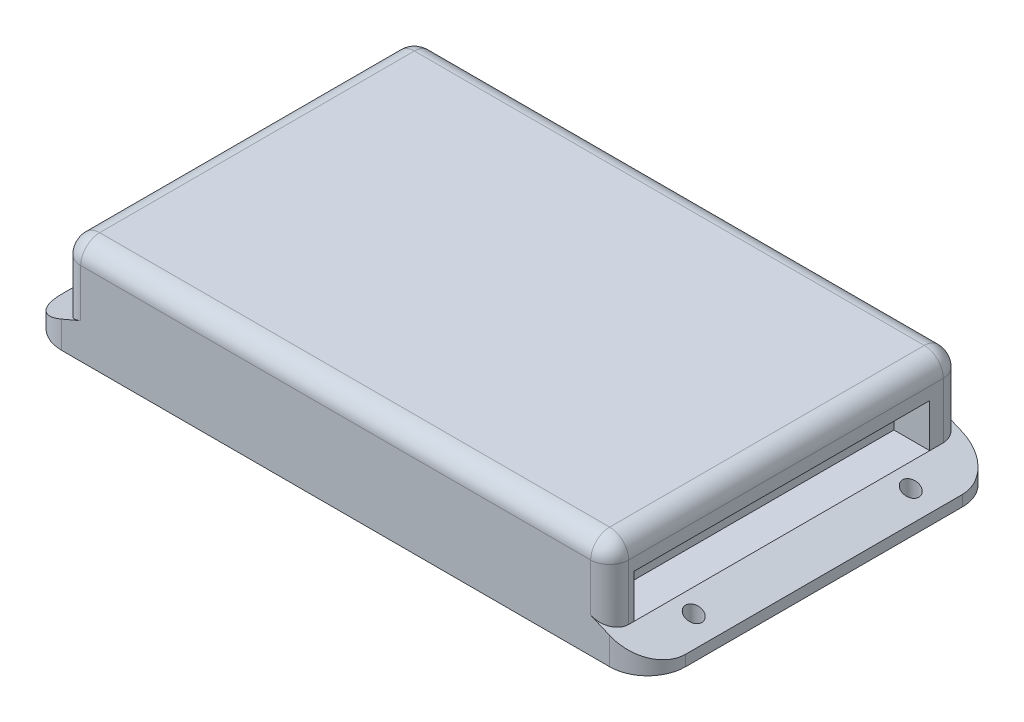
ISO-10303-21;
HEADER;
FILE_DESCRIPTION(('STEP AP214'),'2;1');
FILE_NAME('part.step','',(''),(''),'','','');
FILE_SCHEMA(('AUTOMOTIVE_DESIGN { 1 0 10303 214 1 1 1 1 }'));
ENDSEC;
DATA;
#1=APPLICATION_CONTEXT('core data for automotive mechanical design processes');
#2=APPLICATION_PROTOCOL_DEFINITION('international standard','automotive_design',2000,#1);
#3=PRODUCT_CONTEXT('',#1,'mechanical');
#4=PRODUCT('Part','Part','',(#3));
#5=PRODUCT_RELATED_PRODUCT_CATEGORY('part','',(#4));
#6=PRODUCT_DEFINITION_FORMATION('','',#4);
#7=PRODUCT_DEFINITION_CONTEXT('part definition',#1,'design');
#8=PRODUCT_DEFINITION('design','',#6,#7);
#9=PRODUCT_DEFINITION_SHAPE('','',#8);
#10=(LENGTH_UNIT() NAMED_UNIT(*) SI_UNIT(.MILLI.,.METRE.));
#11=(NAMED_UNIT(*) PLANE_ANGLE_UNIT() SI_UNIT($,.RADIAN.));
#12=(NAMED_UNIT(*) SI_UNIT($,.STERADIAN.) SOLID_ANGLE_UNIT());
#13=UNCERTAINTY_MEASURE_WITH_UNIT(LENGTH_MEASURE(1.E-05),#10,'distance_accuracy_value','');
#14=(GEOMETRIC_REPRESENTATION_CONTEXT(3) GLOBAL_UNCERTAINTY_ASSIGNED_CONTEXT((#13)) GLOBAL_UNIT_ASSIGNED_CONTEXT((#10,
#11,#12)) REPRESENTATION_CONTEXT('',''));
#15=CARTESIAN_POINT('',(0.,0.,0.));
#16=DIRECTION('',(0.,0.,1.));
#17=DIRECTION('',(1.,0.,0.));
#18=AXIS2_PLACEMENT_3D('',#15,#16,#17);
#19=CARTESIAN_POINT('',(57.5,5.,32.5));
#20=DIRECTION('',(-1.,0.,0.));
#21=DIRECTION('',(0.,0.,1.));
#22=AXIS2_PLACEMENT_3D('',#19,#20,#21);
#23=PLANE('',#22);
#24=DIRECTION('',(0.,0.,-1.));
#25=VECTOR('',#24,1.);
#26=CARTESIAN_POINT('',(57.5,0.,32.5));
#27=LINE('',#26,#25);
#28=CARTESIAN_POINT('',(57.5,0.,25.5));
#29=VERTEX_POINT('',#28);
#30=CARTESIAN_POINT('',(57.5,0.,-25.5));
#31=VERTEX_POINT('',#30);
#32=EDGE_CURVE('E296',#29,#31,#27,.T.);
#33=ORIENTED_EDGE('',*,*,#32,.T.);
#34=DIRECTION('',(0.,-1.,0.));
#35=VECTOR('',#34,1.);
#36=CARTESIAN_POINT('',(57.5,5.,-25.5));
#37=LINE('',#36,#35);
#38=CARTESIAN_POINT('',(57.5,2.,-25.5));
#39=VERTEX_POINT('',#38);
#40=EDGE_CURVE('E367',#31,#39,#37,.F.);
#41=ORIENTED_EDGE('',*,*,#40,.T.);
#42=DIRECTION('',(0.,0.,1.));
#43=VECTOR('',#42,1.);
#44=CARTESIAN_POINT('',(57.5,2.,32.5));
#45=LINE('',#44,#43);
#46=CARTESIAN_POINT('',(57.5,2.,25.5));
#47=VERTEX_POINT('',#46);
#48=EDGE_CURVE('E323',#39,#47,#45,.T.);
#49=ORIENTED_EDGE('',*,*,#48,.T.);
#50=DIRECTION('',(0.,-1.,0.));
#51=VECTOR('',#50,1.);
#52=CARTESIAN_POINT('',(57.5,5.,25.5));
#53=LINE('',#52,#51);
#54=EDGE_CURVE('E364',#47,#29,#53,.T.);
#55=ORIENTED_EDGE('',*,*,#54,.T.);
#56=EDGE_LOOP('',(#33,#41,#49,#55));
#57=FACE_BOUND('',#56,.T.);
#58=ADVANCED_FACE('F41',(#57),#23,.F.);
#59=CARTESIAN_POINT('',(-57.5,5.,-32.5));
#60=DIRECTION('',(0.,0.,1.));
#61=DIRECTION('',(1.,0.,0.));
#62=AXIS2_PLACEMENT_3D('',#59,#60,#61);
#63=PLANE('',#62);
#64=DIRECTION('',(0.,-1.,0.));
#65=VECTOR('',#64,1.);
#66=CARTESIAN_POINT('',(46.9999999999999,5.,-32.5));
#67=LINE('',#66,#65);
#68=CARTESIAN_POINT('',(46.9999999999999,15.3,-32.5));
#69=VERTEX_POINT('',#68);
#70=CARTESIAN_POINT('',(46.9999999999999,6.49999999999999,-32.5));
#71=VERTEX_POINT('',#70);
#72=EDGE_CURVE('E415',#69,#71,#67,.T.);
#73=ORIENTED_EDGE('',*,*,#72,.T.);
#74=DIRECTION('',(-0.919145030018059,0.393919298579166,0.));
#75=VECTOR('',#74,1.);
#76=CARTESIAN_POINT('',(50.5,5.,-32.5));
#77=LINE('',#76,#75);
#78=CARTESIAN_POINT('',(50.5,5.,-32.5));
#79=VERTEX_POINT('',#78);
#80=EDGE_CURVE('E418',#71,#79,#77,.F.);
#81=ORIENTED_EDGE('',*,*,#80,.T.);
#82=DIRECTION('',(0.,-1.,0.));
#83=VECTOR('',#82,1.);
#84=CARTESIAN_POINT('',(50.5,5.,-32.5));
#85=LINE('',#84,#83);
#86=CARTESIAN_POINT('',(50.5,0.,-32.5));
#87=VERTEX_POINT('',#86);
#88=EDGE_CURVE('E347',#79,#87,#85,.T.);
#89=ORIENTED_EDGE('',*,*,#88,.T.);
#90=DIRECTION('',(-1.,0.,0.));
#91=VECTOR('',#90,1.);
#92=CARTESIAN_POINT('',(-57.5,0.,-32.5));
#93=LINE('',#92,#91);
#94=CARTESIAN_POINT('',(-50.5,0.,-32.5));
#95=VERTEX_POINT('',#94);
#96=EDGE_CURVE('E303',#87,#95,#93,.T.);
#97=ORIENTED_EDGE('',*,*,#96,.T.);
#98=DIRECTION('',(0.,-1.,0.));
#99=VECTOR('',#98,1.);
#100=CARTESIAN_POINT('',(-50.5,5.,-32.5));
#101=LINE('',#100,#99);
#102=CARTESIAN_POINT('',(-50.5,5.,-32.5));
#103=VERTEX_POINT('',#102);
#104=EDGE_CURVE('E350',#95,#103,#101,.F.);
#105=ORIENTED_EDGE('',*,*,#104,.T.);
#106=DIRECTION('',(-0.919145030018059,-0.393919298579166,0.));
#107=VECTOR('',#106,1.);
#108=CARTESIAN_POINT('',(-50.5,5.,-32.5));
#109=LINE('',#108,#107);
#110=CARTESIAN_POINT('',(-46.9999999999999,6.5,-32.5));
#111=VERTEX_POINT('',#110);
#112=EDGE_CURVE('E410',#103,#111,#109,.F.);
#113=ORIENTED_EDGE('',*,*,#112,.T.);
#114=DIRECTION('',(0.,-1.,0.));
#115=VECTOR('',#114,1.);
#116=CARTESIAN_POINT('',(-46.9999999999999,5.,-32.5));
#117=LINE('',#116,#115);
#118=CARTESIAN_POINT('',(-46.9999999999999,15.3,-32.5));
#119=VERTEX_POINT('',#118);
#120=EDGE_CURVE('E408',#111,#119,#117,.F.);
#121=ORIENTED_EDGE('',*,*,#120,.T.);
#122=DIRECTION('',(1.,0.,0.));
#123=VECTOR('',#122,1.);
#124=CARTESIAN_POINT('',(-57.5,15.3,-32.5));
#125=LINE('',#124,#123);
#126=EDGE_CURVE('E413',#119,#69,#125,.T.);
#127=ORIENTED_EDGE('',*,*,#126,.T.);
#128=EDGE_LOOP('',(#73,#81,#89,#97,#105,#113,#121,#127));
#129=FACE_BOUND('',#128,.T.);
#130=ADVANCED_FACE('F471',(#129),#63,.F.);
#131=CARTESIAN_POINT('',(-57.5,5.,32.5));
#132=DIRECTION('',(1.,0.,0.));
#133=DIRECTION('',(0.,0.,-1.));
#134=AXIS2_PLACEMENT_3D('',#131,#132,#133);
#135=PLANE('',#134);
#136=DIRECTION('',(0.,0.,-1.));
#137=VECTOR('',#136,1.);
#138=CARTESIAN_POINT('',(-57.5,2.,32.5));
#139=LINE('',#138,#137);
#140=CARTESIAN_POINT('',(-57.5,2.,25.5));
#141=VERTEX_POINT('',#140);
#142=CARTESIAN_POINT('',(-57.5,2.,-25.5));
#143=VERTEX_POINT('',#142);
#144=EDGE_CURVE('E320',#141,#143,#139,.T.);
#145=ORIENTED_EDGE('',*,*,#144,.T.);
#146=DIRECTION('',(0.,-1.,0.));
#147=VECTOR('',#146,1.);
#148=CARTESIAN_POINT('',(-57.5,5.,-25.5));
#149=LINE('',#148,#147);
#150=CARTESIAN_POINT('',(-57.5,0.,-25.5));
#151=VERTEX_POINT('',#150);
#152=EDGE_CURVE('E336',#143,#151,#149,.T.);
#153=ORIENTED_EDGE('',*,*,#152,.T.);
#154=DIRECTION('',(0.,0.,1.));
#155=VECTOR('',#154,1.);
#156=CARTESIAN_POINT('',(-57.5,0.,32.5));
#157=LINE('',#156,#155);
#158=CARTESIAN_POINT('',(-57.5,0.,25.5));
#159=VERTEX_POINT('',#158);
#160=EDGE_CURVE('E306',#151,#159,#157,.T.);
#161=ORIENTED_EDGE('',*,*,#160,.T.);
#162=DIRECTION('',(0.,-1.,0.));
#163=VECTOR('',#162,1.);
#164=CARTESIAN_POINT('',(-57.5,5.,25.5));
#165=LINE('',#164,#163);
#166=EDGE_CURVE('E326',#159,#141,#165,.F.);
#167=ORIENTED_EDGE('',*,*,#166,.T.);
#168=EDGE_LOOP('',(#145,#153,#161,#167));
#169=FACE_BOUND('',#168,.T.);
#170=ADVANCED_FACE('F510',(#169),#135,.F.);
#171=CARTESIAN_POINT('',(-57.5,5.,32.5));
#172=DIRECTION('',(0.,0.,-1.));
#173=DIRECTION('',(-1.,0.,0.));
#174=AXIS2_PLACEMENT_3D('',#171,#172,#173);
#175=PLANE('',#174);
#176=DIRECTION('',(0.,-1.,0.));
#177=VECTOR('',#176,1.);
#178=CARTESIAN_POINT('',(-46.9999999999999,5.,32.5));
#179=LINE('',#178,#177);
#180=CARTESIAN_POINT('',(-46.9999999999999,15.3,32.5));
#181=VERTEX_POINT('',#180);
#182=CARTESIAN_POINT('',(-46.9999999999999,6.5,32.5));
#183=VERTEX_POINT('',#182);
#184=EDGE_CURVE('E397',#181,#183,#179,.T.);
#185=ORIENTED_EDGE('',*,*,#184,.T.);
#186=DIRECTION('',(0.919145030018059,0.393919298579166,0.));
#187=VECTOR('',#186,1.);
#188=CARTESIAN_POINT('',(-50.5,5.,32.5));
#189=LINE('',#188,#187);
#190=CARTESIAN_POINT('',(-50.5,5.,32.5));
#191=VERTEX_POINT('',#190);
#192=EDGE_CURVE('E400',#183,#191,#189,.F.);
#193=ORIENTED_EDGE('',*,*,#192,.T.);
#194=DIRECTION('',(0.,-1.,0.));
#195=VECTOR('',#194,1.);
#196=CARTESIAN_POINT('',(-50.5,5.,32.5));
#197=LINE('',#196,#195);
#198=CARTESIAN_POINT('',(-50.5,0.,32.5));
#199=VERTEX_POINT('',#198);
#200=EDGE_CURVE('E361',#191,#199,#197,.T.);
#201=ORIENTED_EDGE('',*,*,#200,.T.);
#202=DIRECTION('',(1.,0.,0.));
#203=VECTOR('',#202,1.);
#204=CARTESIAN_POINT('',(-57.5,0.,32.5));
#205=LINE('',#204,#203);
#206=CARTESIAN_POINT('',(50.5,0.,32.5));
#207=VERTEX_POINT('',#206);
#208=EDGE_CURVE('E309',#199,#207,#205,.T.);
#209=ORIENTED_EDGE('',*,*,#208,.T.);
#210=DIRECTION('',(0.,-1.,0.));
#211=VECTOR('',#210,1.);
#212=CARTESIAN_POINT('',(50.5,5.,32.5));
#213=LINE('',#212,#211);
#214=CARTESIAN_POINT('',(50.5,5.,32.5));
#215=VERTEX_POINT('',#214);
#216=EDGE_CURVE('E358',#207,#215,#213,.F.);
#217=ORIENTED_EDGE('',*,*,#216,.T.);
#218=DIRECTION('',(0.919145030018059,-0.393919298579166,0.));
#219=VECTOR('',#218,1.);
#220=CARTESIAN_POINT('',(50.5,5.,32.5));
#221=LINE('',#220,#219);
#222=CARTESIAN_POINT('',(46.9999999999999,6.49999999999999,32.5));
#223=VERTEX_POINT('',#222);
#224=EDGE_CURVE('E392',#215,#223,#221,.F.);
#225=ORIENTED_EDGE('',*,*,#224,.T.);
#226=DIRECTION('',(0.,-1.,0.));
#227=VECTOR('',#226,1.);
#228=CARTESIAN_POINT('',(46.9999999999999,5.,32.5));
#229=LINE('',#228,#227);
#230=CARTESIAN_POINT('',(46.9999999999999,15.3,32.5));
#231=VERTEX_POINT('',#230);
#232=EDGE_CURVE('E390',#223,#231,#229,.F.);
#233=ORIENTED_EDGE('',*,*,#232,.T.);
#234=DIRECTION('',(-1.,0.,0.));
#235=VECTOR('',#234,1.);
#236=CARTESIAN_POINT('',(-57.5,15.3,32.5));
#237=LINE('',#236,#235);
#238=EDGE_CURVE('E395',#231,#181,#237,.T.);
#239=ORIENTED_EDGE('',*,*,#238,.T.);
#240=EDGE_LOOP('',(#185,#193,#201,#209,#217,#225,#233,#239));
#241=FACE_BOUND('',#240,.T.);
#242=ADVANCED_FACE('F503',(#241),#175,.F.);
#243=CARTESIAN_POINT('',(0.,0.,0.));
#244=DIRECTION('',(0.,-1.,0.));
#245=DIRECTION('',(0.,0.,-1.));
#246=AXIS2_PLACEMENT_3D('',#243,#244,#245);
#247=PLANE('',#246);
#248=CARTESIAN_POINT('',(-53.5,0.,-20.));
#249=DIRECTION('',(0.,-1.,0.));
#250=DIRECTION('',(0.,0.,1.));
#251=AXIS2_PLACEMENT_3D('',#248,#249,#250);
#252=CIRCLE('',#251,1.5);
#253=CARTESIAN_POINT('',(-53.5,0.,-18.5));
#254=VERTEX_POINT('',#253);
#255=EDGE_CURVE('E284',#254,#254,#252,.T.);
#256=ORIENTED_EDGE('',*,*,#255,.F.);
#257=EDGE_LOOP('',(#256));
#258=FACE_BOUND('',#257,.T.);
#259=CARTESIAN_POINT('',(-53.5,0.,20.));
#260=DIRECTION('',(0.,-1.,0.));
#261=DIRECTION('',(0.,0.,1.));
#262=AXIS2_PLACEMENT_3D('',#259,#260,#261);
#263=CIRCLE('',#262,1.5);
#264=CARTESIAN_POINT('',(-53.5,0.,21.5));
#265=VERTEX_POINT('',#264);
#266=EDGE_CURVE('E289',#265,#265,#263,.T.);
#267=ORIENTED_EDGE('',*,*,#266,.F.);
#268=EDGE_LOOP('',(#267));
#269=FACE_BOUND('',#268,.T.);
#270=CARTESIAN_POINT('',(53.5,0.,-20.));
#271=DIRECTION('',(0.,1.,0.));
#272=DIRECTION('',(0.,0.,1.));
#273=AXIS2_PLACEMENT_3D('',#270,#271,#272);
#274=CIRCLE('',#273,1.5);
#275=CARTESIAN_POINT('',(53.5,0.,-18.5));
#276=VERTEX_POINT('',#275);
#277=EDGE_CURVE('E293',#276,#276,#274,.T.);
#278=ORIENTED_EDGE('',*,*,#277,.T.);
#279=EDGE_LOOP('',(#278));
#280=FACE_BOUND('',#279,.T.);
#281=CARTESIAN_POINT('',(53.5,0.,20.));
#282=DIRECTION('',(0.,1.,0.));
#283=DIRECTION('',(0.,0.,1.));
#284=AXIS2_PLACEMENT_3D('',#281,#282,#283);
#285=CIRCLE('',#284,1.5);
#286=CARTESIAN_POINT('',(53.5,0.,21.5));
#287=VERTEX_POINT('',#286);
#288=EDGE_CURVE('E287',#287,#287,#285,.T.);
#289=ORIENTED_EDGE('',*,*,#288,.T.);
#290=EDGE_LOOP('',(#289));
#291=FACE_BOUND('',#290,.T.);
#292=ORIENTED_EDGE('',*,*,#160,.F.);
#293=CARTESIAN_POINT('',(-50.5,0.,-25.5));
#294=DIRECTION('',(0.,-1.,0.));
#295=DIRECTION('',(0.,0.,-1.));
#296=AXIS2_PLACEMENT_3D('',#293,#294,#295);
#297=CIRCLE('',#296,7.);
#298=EDGE_CURVE('E345',#151,#95,#297,.T.);
#299=ORIENTED_EDGE('',*,*,#298,.T.);
#300=ORIENTED_EDGE('',*,*,#96,.F.);
#301=CARTESIAN_POINT('',(50.5,0.,-25.5));
#302=DIRECTION('',(0.,-1.,0.));
#303=DIRECTION('',(0.,0.,-1.));
#304=AXIS2_PLACEMENT_3D('',#301,#302,#303);
#305=CIRCLE('',#304,7.);
#306=EDGE_CURVE('E341',#87,#31,#305,.T.);
#307=ORIENTED_EDGE('',*,*,#306,.T.);
#308=ORIENTED_EDGE('',*,*,#32,.F.);
#309=CARTESIAN_POINT('',(50.5,0.,25.5));
#310=DIRECTION('',(0.,-1.,0.));
#311=DIRECTION('',(0.,0.,-1.));
#312=AXIS2_PLACEMENT_3D('',#309,#310,#311);
#313=CIRCLE('',#312,7.);
#314=EDGE_CURVE('E339',#29,#207,#313,.T.);
#315=ORIENTED_EDGE('',*,*,#314,.T.);
#316=ORIENTED_EDGE('',*,*,#208,.F.);
#317=CARTESIAN_POINT('',(-50.5,0.,25.5));
#318=DIRECTION('',(0.,-1.,0.));
#319=DIRECTION('',(0.,0.,-1.));
#320=AXIS2_PLACEMENT_3D('',#317,#318,#319);
#321=CIRCLE('',#320,7.);
#322=EDGE_CURVE('E343',#199,#159,#321,.T.);
#323=ORIENTED_EDGE('',*,*,#322,.T.);
#324=EDGE_LOOP('',(#292,#299,#300,#307,#308,#315,#316,#323));
#325=FACE_BOUND('',#324,.T.);
#326=ADVANCED_FACE('F494',(#258,#269,#280,#291,#325),#247,.T.);
#327=CARTESIAN_POINT('',(53.5,0.,20.));
#328=DIRECTION('',(0.,1.,0.));
#329=DIRECTION('',(0.,0.,1.));
#330=AXIS2_PLACEMENT_3D('',#327,#328,#329);
#331=CYLINDRICAL_SURFACE('',#330,1.5);
#332=ORIENTED_EDGE('',*,*,#288,.F.);
#333=EDGE_LOOP('',(#332));
#334=FACE_BOUND('',#333,.T.);
#335=CARTESIAN_POINT('',(53.5,3.7142857142857,20.));
#336=DIRECTION('',(-0.393919298579166,-0.919145030018059,0.));
#337=DIRECTION('',(-0.919145030018059,0.393919298579166,0.));
#338=AXIS2_PLACEMENT_3D('',#335,#336,#337);
#339=ELLIPSE('',#338,1.63195137982798,1.5);
#340=CARTESIAN_POINT('',(52.,4.35714285714284,20.));
#341=VERTEX_POINT('',#340);
#342=EDGE_CURVE('E300',#341,#341,#339,.F.);
#343=ORIENTED_EDGE('',*,*,#342,.T.);
#344=EDGE_LOOP('',(#343));
#345=FACE_BOUND('',#344,.T.);
#346=ADVANCED_FACE('F657',(#334,#345),#331,.F.);
#347=CARTESIAN_POINT('',(53.5,0.,-20.));
#348=DIRECTION('',(0.,1.,0.));
#349=DIRECTION('',(0.,0.,1.));
#350=AXIS2_PLACEMENT_3D('',#347,#348,#349);
#351=CYLINDRICAL_SURFACE('',#350,1.5);
#352=ORIENTED_EDGE('',*,*,#277,.F.);
#353=EDGE_LOOP('',(#352));
#354=FACE_BOUND('',#353,.T.);
#355=CARTESIAN_POINT('',(53.5,3.7142857142857,-20.));
#356=DIRECTION('',(-0.393919298579166,-0.919145030018059,0.));
#357=DIRECTION('',(-0.919145030018059,0.393919298579166,0.));
#358=AXIS2_PLACEMENT_3D('',#355,#356,#357);
#359=ELLIPSE('',#358,1.63195137982798,1.5);
#360=CARTESIAN_POINT('',(52.,4.35714285714284,-20.));
#361=VERTEX_POINT('',#360);
#362=EDGE_CURVE('E297',#361,#361,#359,.F.);
#363=ORIENTED_EDGE('',*,*,#362,.T.);
#364=EDGE_LOOP('',(#363));
#365=FACE_BOUND('',#364,.T.);
#366=ADVANCED_FACE('F653',(#354,#365),#351,.F.);
#367=CARTESIAN_POINT('',(-53.5,0.,20.));
#368=DIRECTION('',(0.,1.,0.));
#369=DIRECTION('',(0.,0.,1.));
#370=AXIS2_PLACEMENT_3D('',#367,#368,#369);
#371=CYLINDRICAL_SURFACE('',#370,1.5);
#372=ORIENTED_EDGE('',*,*,#266,.T.);
#373=EDGE_LOOP('',(#372));
#374=FACE_BOUND('',#373,.T.);
#375=CARTESIAN_POINT('',(-53.5,3.71428571428571,20.));
#376=DIRECTION('',(0.393919298579166,-0.919145030018059,0.));
#377=DIRECTION('',(0.919145030018059,0.393919298579166,0.));
#378=AXIS2_PLACEMENT_3D('',#375,#376,#377);
#379=ELLIPSE('',#378,1.63195137982798,1.5);
#380=CARTESIAN_POINT('',(-52.,4.35714285714285,20.));
#381=VERTEX_POINT('',#380);
#382=EDGE_CURVE('E292',#381,#381,#379,.T.);
#383=ORIENTED_EDGE('',*,*,#382,.F.);
#384=EDGE_LOOP('',(#383));
#385=FACE_BOUND('',#384,.T.);
#386=ADVANCED_FACE('F649',(#374,#385),#371,.F.);
#387=CARTESIAN_POINT('',(-53.5,0.,-20.));
#388=DIRECTION('',(0.,1.,0.));
#389=DIRECTION('',(0.,0.,1.));
#390=AXIS2_PLACEMENT_3D('',#387,#388,#389);
#391=CYLINDRICAL_SURFACE('',#390,1.5);
#392=ORIENTED_EDGE('',*,*,#255,.T.);
#393=EDGE_LOOP('',(#392));
#394=FACE_BOUND('',#393,.T.);
#395=CARTESIAN_POINT('',(-53.5,3.71428571428571,-20.));
#396=DIRECTION('',(0.393919298579166,-0.919145030018059,0.));
#397=DIRECTION('',(0.919145030018059,0.393919298579166,0.));
#398=AXIS2_PLACEMENT_3D('',#395,#396,#397);
#399=ELLIPSE('',#398,1.63195137982798,1.5);
#400=CARTESIAN_POINT('',(-52.,4.35714285714285,-20.));
#401=VERTEX_POINT('',#400);
#402=EDGE_CURVE('E288',#401,#401,#399,.T.);
#403=ORIENTED_EDGE('',*,*,#402,.F.);
#404=EDGE_LOOP('',(#403));
#405=FACE_BOUND('',#404,.T.);
#406=ADVANCED_FACE('F567',(#394,#405),#391,.F.);
#407=CARTESIAN_POINT('',(-50.5,5.,0.));
#408=DIRECTION('',(0.393919298579166,-0.919145030018059,0.));
#409=DIRECTION('',(0.,0.,1.));
#410=AXIS2_PLACEMENT_3D('',#407,#408,#409);
#411=PLANE('',#410);
#412=DIRECTION('',(0.,0.,1.));
#413=VECTOR('',#412,1.);
#414=CARTESIAN_POINT('',(-50.5,5.,0.));
#415=LINE('',#414,#413);
#416=CARTESIAN_POINT('',(-50.5,5.,-29.));
#417=VERTEX_POINT('',#416);
#418=CARTESIAN_POINT('',(-50.5,5.,-13.5));
#419=VERTEX_POINT('',#418);
#420=EDGE_CURVE('E317',#417,#419,#415,.T.);
#421=ORIENTED_EDGE('',*,*,#420,.F.);
#422=CARTESIAN_POINT('',(-46.9999999999999,6.50000000000001,-29.));
#423=DIRECTION('',(0.393919298579166,-0.919145030018059,0.));
#424=DIRECTION('',(-0.919145030018059,-0.393919298579166,0.));
#425=AXIS2_PLACEMENT_3D('',#422,#423,#424);
#426=ELLIPSE('',#425,3.80788655293195,3.5);
#427=EDGE_CURVE('E423',#417,#111,#426,.T.);
#428=ORIENTED_EDGE('',*,*,#427,.T.);
#429=ORIENTED_EDGE('',*,*,#112,.F.);
#430=CARTESIAN_POINT('',(-50.5,4.99999999999998,-25.5));
#431=DIRECTION('',(0.393919298579166,-0.919145030018059,0.));
#432=DIRECTION('',(-0.919145030018059,-0.393919298579166,0.));
#433=AXIS2_PLACEMENT_3D('',#430,#431,#432);
#434=ELLIPSE('',#433,7.6157731058639,7.);
#435=EDGE_CURVE('E356',#103,#143,#434,.F.);
#436=ORIENTED_EDGE('',*,*,#435,.T.);
#437=ORIENTED_EDGE('',*,*,#144,.F.);
#438=CARTESIAN_POINT('',(-50.5,4.99999999999998,25.5));
#439=DIRECTION('',(0.393919298579166,-0.919145030018059,0.));
#440=DIRECTION('',(-0.919145030018059,-0.393919298579166,0.));
#441=AXIS2_PLACEMENT_3D('',#438,#439,#440);
#442=ELLIPSE('',#441,7.6157731058639,7.);
#443=EDGE_CURVE('E353',#141,#191,#442,.F.);
#444=ORIENTED_EDGE('',*,*,#443,.T.);
#445=ORIENTED_EDGE('',*,*,#192,.F.);
#446=CARTESIAN_POINT('',(-46.9999999999999,6.5,29.));
#447=DIRECTION('',(0.393919298579166,-0.919145030018059,0.));
#448=DIRECTION('',(-0.919145030018059,-0.393919298579166,0.));
#449=AXIS2_PLACEMENT_3D('',#446,#447,#448);
#450=ELLIPSE('',#449,3.80788655293195,3.5);
#451=CARTESIAN_POINT('',(-50.5,5.,29.));
#452=VERTEX_POINT('',#451);
#453=EDGE_CURVE('E50',#183,#452,#450,.T.);
#454=ORIENTED_EDGE('',*,*,#453,.T.);
#455=CARTESIAN_POINT('',(-50.5,5.,12.5));
#456=VERTEX_POINT('',#455);
#457=EDGE_CURVE('E316',#456,#452,#415,.T.);
#458=ORIENTED_EDGE('',*,*,#457,.F.);
#459=DIRECTION('',(0.,0.,1.));
#460=VECTOR('',#459,1.);
#461=CARTESIAN_POINT('',(-50.5,5.,12.5));
#462=LINE('',#461,#460);
#463=EDGE_CURVE('E268',#419,#456,#462,.T.);
#464=ORIENTED_EDGE('',*,*,#463,.F.);
#465=EDGE_LOOP('',(#421,#428,#429,#436,#437,#444,#445,#454,#458,#464));
#466=FACE_BOUND('',#465,.T.);
#467=ORIENTED_EDGE('',*,*,#382,.T.);
#468=EDGE_LOOP('',(#467));
#469=FACE_BOUND('',#468,.T.);
#470=ORIENTED_EDGE('',*,*,#402,.T.);
#471=EDGE_LOOP('',(#470));
#472=FACE_BOUND('',#471,.T.);
#473=ADVANCED_FACE('F525',(#466,#469,#472),#411,.F.);
#474=CARTESIAN_POINT('',(50.5,5.,0.));
#475=DIRECTION('',(-0.393919298579166,-0.919145030018059,0.));
#476=DIRECTION('',(0.,0.,-1.));
#477=AXIS2_PLACEMENT_3D('',#474,#475,#476);
#478=PLANE('',#477);
#479=ORIENTED_EDGE('',*,*,#48,.F.);
#480=CARTESIAN_POINT('',(50.5,4.99999999999998,-25.5));
#481=DIRECTION('',(-0.393919298579166,-0.919145030018059,0.));
#482=DIRECTION('',(0.919145030018059,-0.393919298579166,0.));
#483=AXIS2_PLACEMENT_3D('',#480,#481,#482);
#484=ELLIPSE('',#483,7.6157731058639,7.);
#485=EDGE_CURVE('E371',#39,#79,#484,.F.);
#486=ORIENTED_EDGE('',*,*,#485,.T.);
#487=ORIENTED_EDGE('',*,*,#80,.F.);
#488=CARTESIAN_POINT('',(46.9999999999999,6.49999999999999,-29.));
#489=DIRECTION('',(-0.393919298579166,-0.919145030018059,0.));
#490=DIRECTION('',(0.919145030018059,-0.393919298579166,0.));
#491=AXIS2_PLACEMENT_3D('',#488,#489,#490);
#492=ELLIPSE('',#491,3.80788655293195,3.5);
#493=CARTESIAN_POINT('',(50.5,5.,-29.));
#494=VERTEX_POINT('',#493);
#495=EDGE_CURVE('E420',#71,#494,#492,.T.);
#496=ORIENTED_EDGE('',*,*,#495,.T.);
#497=DIRECTION('',(0.,0.,-1.));
#498=VECTOR('',#497,1.);
#499=CARTESIAN_POINT('',(50.5,5.,0.));
#500=LINE('',#499,#498);
#501=CARTESIAN_POINT('',(50.5,5.,-26.5));
#502=VERTEX_POINT('',#501);
#503=EDGE_CURVE('E312',#502,#494,#500,.T.);
#504=ORIENTED_EDGE('',*,*,#503,.F.);
#505=DIRECTION('',(0.,0.,-1.));
#506=VECTOR('',#505,1.);
#507=CARTESIAN_POINT('',(50.5,5.,28.));
#508=LINE('',#507,#506);
#509=CARTESIAN_POINT('',(50.5,5.,28.));
#510=VERTEX_POINT('',#509);
#511=EDGE_CURVE('E235',#510,#502,#508,.T.);
#512=ORIENTED_EDGE('',*,*,#511,.F.);
#513=CARTESIAN_POINT('',(50.5,5.,29.));
#514=VERTEX_POINT('',#513);
#515=EDGE_CURVE('E313',#514,#510,#500,.T.);
#516=ORIENTED_EDGE('',*,*,#515,.F.);
#517=CARTESIAN_POINT('',(46.9999999999999,6.50000000000001,29.));
#518=DIRECTION('',(-0.393919298579166,-0.919145030018059,0.));
#519=DIRECTION('',(0.919145030018059,-0.393919298579166,0.));
#520=AXIS2_PLACEMENT_3D('',#517,#518,#519);
#521=ELLIPSE('',#520,3.80788655293195,3.5);
#522=EDGE_CURVE('E12',#514,#223,#521,.T.);
#523=ORIENTED_EDGE('',*,*,#522,.T.);
#524=ORIENTED_EDGE('',*,*,#224,.F.);
#525=CARTESIAN_POINT('',(50.5,4.99999999999998,25.5));
#526=DIRECTION('',(-0.393919298579166,-0.919145030018059,0.));
#527=DIRECTION('',(0.919145030018059,-0.393919298579166,0.));
#528=AXIS2_PLACEMENT_3D('',#525,#526,#527);
#529=ELLIPSE('',#528,7.6157731058639,7.);
#530=EDGE_CURVE('E369',#215,#47,#529,.F.);
#531=ORIENTED_EDGE('',*,*,#530,.T.);
#532=EDGE_LOOP('',(#479,#486,#487,#496,#504,#512,#516,#523,#524,#531));
#533=FACE_BOUND('',#532,.T.);
#534=ORIENTED_EDGE('',*,*,#342,.F.);
#535=EDGE_LOOP('',(#534));
#536=FACE_BOUND('',#535,.T.);
#537=ORIENTED_EDGE('',*,*,#362,.F.);
#538=EDGE_LOOP('',(#537));
#539=FACE_BOUND('',#538,.T.);
#540=ADVANCED_FACE('F482',(#533,#536,#539),#478,.F.);
#541=CARTESIAN_POINT('',(-50.5,5.,-25.5));
#542=DIRECTION('',(0.,-1.,0.));
#543=DIRECTION('',(0.,0.,-1.));
#544=AXIS2_PLACEMENT_3D('',#541,#542,#543);
#545=CYLINDRICAL_SURFACE('',#544,7.);
#546=ORIENTED_EDGE('',*,*,#435,.F.);
#547=ORIENTED_EDGE('',*,*,#104,.F.);
#548=ORIENTED_EDGE('',*,*,#298,.F.);
#549=ORIENTED_EDGE('',*,*,#152,.F.);
#550=EDGE_LOOP('',(#546,#547,#548,#549));
#551=FACE_BOUND('',#550,.T.);
#552=ADVANCED_FACE('F515',(#551),#545,.T.);
#553=CARTESIAN_POINT('',(-50.5,5.,25.5));
#554=DIRECTION('',(0.,-1.,0.));
#555=DIRECTION('',(0.,0.,-1.));
#556=AXIS2_PLACEMENT_3D('',#553,#554,#555);
#557=CYLINDRICAL_SURFACE('',#556,7.);
#558=ORIENTED_EDGE('',*,*,#443,.F.);
#559=ORIENTED_EDGE('',*,*,#166,.F.);
#560=ORIENTED_EDGE('',*,*,#322,.F.);
#561=ORIENTED_EDGE('',*,*,#200,.F.);
#562=EDGE_LOOP('',(#558,#559,#560,#561));
#563=FACE_BOUND('',#562,.T.);
#564=ADVANCED_FACE('F507',(#563),#557,.T.);
#565=CARTESIAN_POINT('',(50.5,5.,-25.5));
#566=DIRECTION('',(0.,-1.,0.));
#567=DIRECTION('',(0.,0.,-1.));
#568=AXIS2_PLACEMENT_3D('',#565,#566,#567);
#569=CYLINDRICAL_SURFACE('',#568,7.);
#570=ORIENTED_EDGE('',*,*,#485,.F.);
#571=ORIENTED_EDGE('',*,*,#40,.F.);
#572=ORIENTED_EDGE('',*,*,#306,.F.);
#573=ORIENTED_EDGE('',*,*,#88,.F.);
#574=EDGE_LOOP('',(#570,#571,#572,#573));
#575=FACE_BOUND('',#574,.T.);
#576=ADVANCED_FACE('F489',(#575),#569,.T.);
#577=CARTESIAN_POINT('',(50.5,5.,25.5));
#578=DIRECTION('',(0.,-1.,0.));
#579=DIRECTION('',(0.,0.,-1.));
#580=AXIS2_PLACEMENT_3D('',#577,#578,#579);
#581=CYLINDRICAL_SURFACE('',#580,7.);
#582=ORIENTED_EDGE('',*,*,#530,.F.);
#583=ORIENTED_EDGE('',*,*,#216,.F.);
#584=ORIENTED_EDGE('',*,*,#314,.F.);
#585=ORIENTED_EDGE('',*,*,#54,.F.);
#586=EDGE_LOOP('',(#582,#583,#584,#585));
#587=FACE_BOUND('',#586,.T.);
#588=ADVANCED_FACE('F499',(#587),#581,.T.);
#589=CARTESIAN_POINT('',(-50.5,157.708284476967,32.5));
#590=DIRECTION('',(1.,0.,0.));
#591=DIRECTION('',(0.,0.,-1.));
#592=AXIS2_PLACEMENT_3D('',#589,#590,#591);
#593=PLANE('',#592);
#594=ORIENTED_EDGE('',*,*,#420,.T.);
#595=DIRECTION('',(0.,-1.,0.));
#596=VECTOR('',#595,1.);
#597=CARTESIAN_POINT('',(-50.5,13.,-13.5));
#598=LINE('',#597,#596);
#599=CARTESIAN_POINT('',(-50.5,13.,-13.5));
#600=VERTEX_POINT('',#599);
#601=EDGE_CURVE('E66',#600,#419,#598,.T.);
#602=ORIENTED_EDGE('',*,*,#601,.F.);
#603=DIRECTION('',(0.,0.,-1.));
#604=VECTOR('',#603,1.);
#605=CARTESIAN_POINT('',(-50.5,13.,12.5));
#606=LINE('',#605,#604);
#607=CARTESIAN_POINT('',(-50.5,13.,12.5));
#608=VERTEX_POINT('',#607);
#609=EDGE_CURVE('E257',#608,#600,#606,.T.);
#610=ORIENTED_EDGE('',*,*,#609,.F.);
#611=DIRECTION('',(0.,1.,0.));
#612=VECTOR('',#611,1.);
#613=CARTESIAN_POINT('',(-50.5,13.,12.5));
#614=LINE('',#613,#612);
#615=EDGE_CURVE('E271',#456,#608,#614,.T.);
#616=ORIENTED_EDGE('',*,*,#615,.F.);
#617=ORIENTED_EDGE('',*,*,#457,.T.);
#618=DIRECTION('',(0.,-1.,0.));
#619=VECTOR('',#618,1.);
#620=CARTESIAN_POINT('',(-50.5,157.708284476967,29.));
#621=LINE('',#620,#619);
#622=CARTESIAN_POINT('',(-50.5,15.3,29.));
#623=VERTEX_POINT('',#622);
#624=EDGE_CURVE('E402',#452,#623,#621,.F.);
#625=ORIENTED_EDGE('',*,*,#624,.T.);
#626=DIRECTION('',(0.,0.,-1.));
#627=VECTOR('',#626,1.);
#628=CARTESIAN_POINT('',(-50.5,15.3,32.5));
#629=LINE('',#628,#627);
#630=CARTESIAN_POINT('',(-50.5,15.3,-29.));
#631=VERTEX_POINT('',#630);
#632=EDGE_CURVE('E404',#623,#631,#629,.T.);
#633=ORIENTED_EDGE('',*,*,#632,.T.);
#634=DIRECTION('',(0.,-1.,0.));
#635=VECTOR('',#634,1.);
#636=CARTESIAN_POINT('',(-50.5,157.708284476967,-29.));
#637=LINE('',#636,#635);
#638=EDGE_CURVE('E406',#631,#417,#637,.T.);
#639=ORIENTED_EDGE('',*,*,#638,.T.);
#640=EDGE_LOOP('',(#594,#602,#610,#616,#617,#625,#633,#639));
#641=FACE_BOUND('',#640,.T.);
#642=ADVANCED_FACE('F523',(#641),#593,.F.);
#643=CARTESIAN_POINT('',(50.5,157.708284476967,32.5));
#644=DIRECTION('',(-1.,0.,0.));
#645=DIRECTION('',(0.,0.,1.));
#646=AXIS2_PLACEMENT_3D('',#643,#644,#645);
#647=PLANE('',#646);
#648=DIRECTION('',(0.,0.,1.));
#649=VECTOR('',#648,1.);
#650=CARTESIAN_POINT('',(50.5,13.,28.));
#651=LINE('',#650,#649);
#652=CARTESIAN_POINT('',(50.5,13.,-26.5));
#653=VERTEX_POINT('',#652);
#654=CARTESIAN_POINT('',(50.5,13.,28.));
#655=VERTEX_POINT('',#654);
#656=EDGE_CURVE('E244',#653,#655,#651,.T.);
#657=ORIENTED_EDGE('',*,*,#656,.F.);
#658=DIRECTION('',(0.,1.,0.));
#659=VECTOR('',#658,1.);
#660=CARTESIAN_POINT('',(50.5,13.,-26.5));
#661=LINE('',#660,#659);
#662=EDGE_CURVE('E58',#502,#653,#661,.T.);
#663=ORIENTED_EDGE('',*,*,#662,.F.);
#664=ORIENTED_EDGE('',*,*,#503,.T.);
#665=DIRECTION('',(0.,-1.,0.));
#666=VECTOR('',#665,1.);
#667=CARTESIAN_POINT('',(50.5,157.708284476967,-29.));
#668=LINE('',#667,#666);
#669=CARTESIAN_POINT('',(50.5,15.3,-29.));
#670=VERTEX_POINT('',#669);
#671=EDGE_CURVE('E379',#494,#670,#668,.F.);
#672=ORIENTED_EDGE('',*,*,#671,.T.);
#673=DIRECTION('',(0.,0.,1.));
#674=VECTOR('',#673,1.);
#675=CARTESIAN_POINT('',(50.5,15.3,32.5));
#676=LINE('',#675,#674);
#677=CARTESIAN_POINT('',(50.5,15.3,29.));
#678=VERTEX_POINT('',#677);
#679=EDGE_CURVE('E376',#670,#678,#676,.T.);
#680=ORIENTED_EDGE('',*,*,#679,.T.);
#681=DIRECTION('',(0.,-1.,0.));
#682=VECTOR('',#681,1.);
#683=CARTESIAN_POINT('',(50.5,157.708284476967,29.));
#684=LINE('',#683,#682);
#685=EDGE_CURVE('E374',#678,#514,#684,.T.);
#686=ORIENTED_EDGE('',*,*,#685,.T.);
#687=ORIENTED_EDGE('',*,*,#515,.T.);
#688=DIRECTION('',(0.,-1.,0.));
#689=VECTOR('',#688,1.);
#690=CARTESIAN_POINT('',(50.5,13.,28.));
#691=LINE('',#690,#689);
#692=EDGE_CURVE('E238',#655,#510,#691,.T.);
#693=ORIENTED_EDGE('',*,*,#692,.F.);
#694=EDGE_LOOP('',(#657,#663,#664,#672,#680,#686,#687,#693));
#695=FACE_BOUND('',#694,.T.);
#696=ADVANCED_FACE('F636',(#695),#647,.F.);
#697=CARTESIAN_POINT('',(0.,18.8,0.));
#698=DIRECTION('',(0.,-1.,0.));
#699=DIRECTION('',(0.,0.,-1.));
#700=AXIS2_PLACEMENT_3D('',#697,#698,#699);
#701=PLANE('',#700);
#702=DIRECTION('',(-1.,0.,0.));
#703=VECTOR('',#702,1.);
#704=CARTESIAN_POINT('',(0.,18.8,29.));
#705=LINE('',#704,#703);
#706=CARTESIAN_POINT('',(-46.9999999999999,18.8,29.));
#707=VERTEX_POINT('',#706);
#708=CARTESIAN_POINT('',(46.9999999999999,18.8,29.));
#709=VERTEX_POINT('',#708);
#710=EDGE_CURVE('E385',#707,#709,#705,.F.);
#711=ORIENTED_EDGE('',*,*,#710,.T.);
#712=DIRECTION('',(0.,0.,1.));
#713=VECTOR('',#712,1.);
#714=CARTESIAN_POINT('',(46.9999999999999,18.8,0.));
#715=LINE('',#714,#713);
#716=CARTESIAN_POINT('',(46.9999999999999,18.8,-29.));
#717=VERTEX_POINT('',#716);
#718=EDGE_CURVE('E387',#709,#717,#715,.F.);
#719=ORIENTED_EDGE('',*,*,#718,.T.);
#720=DIRECTION('',(1.,0.,0.));
#721=VECTOR('',#720,1.);
#722=CARTESIAN_POINT('',(0.,18.8,-29.));
#723=LINE('',#722,#721);
#724=CARTESIAN_POINT('',(-46.9999999999999,18.8,-29.));
#725=VERTEX_POINT('',#724);
#726=EDGE_CURVE('E381',#717,#725,#723,.F.);
#727=ORIENTED_EDGE('',*,*,#726,.T.);
#728=DIRECTION('',(0.,0.,-1.));
#729=VECTOR('',#728,1.);
#730=CARTESIAN_POINT('',(-46.9999999999999,18.8,0.));
#731=LINE('',#730,#729);
#732=EDGE_CURVE('E383',#725,#707,#731,.F.);
#733=ORIENTED_EDGE('',*,*,#732,.T.);
#734=EDGE_LOOP('',(#711,#719,#727,#733));
#735=FACE_BOUND('',#734,.T.);
#736=ADVANCED_FACE('F617',(#735),#701,.F.);
#737=CARTESIAN_POINT('',(-46.9999999999999,157.708284476967,-29.));
#738=DIRECTION('',(0.,-1.,0.));
#739=DIRECTION('',(0.,0.,-1.));
#740=AXIS2_PLACEMENT_3D('',#737,#738,#739);
#741=CYLINDRICAL_SURFACE('',#740,3.5);
#742=ORIENTED_EDGE('',*,*,#427,.F.);
#743=ORIENTED_EDGE('',*,*,#638,.F.);
#744=CARTESIAN_POINT('',(-46.9999999999999,15.3,-29.));
#745=DIRECTION('',(0.,1.,0.));
#746=DIRECTION('',(-1.,0.,0.));
#747=AXIS2_PLACEMENT_3D('',#744,#745,#746);
#748=CIRCLE('',#747,3.5);
#749=EDGE_CURVE('E453',#119,#631,#748,.T.);
#750=ORIENTED_EDGE('',*,*,#749,.F.);
#751=ORIENTED_EDGE('',*,*,#120,.F.);
#752=EDGE_LOOP('',(#742,#743,#750,#751));
#753=FACE_BOUND('',#752,.T.);
#754=ADVANCED_FACE('F43',(#753),#741,.T.);
#755=CARTESIAN_POINT('',(-46.9999999999999,5.,29.));
#756=DIRECTION('',(0.,-1.,0.));
#757=DIRECTION('',(0.,0.,-1.));
#758=AXIS2_PLACEMENT_3D('',#755,#756,#757);
#759=CYLINDRICAL_SURFACE('',#758,3.5);
#760=ORIENTED_EDGE('',*,*,#453,.F.);
#761=ORIENTED_EDGE('',*,*,#184,.F.);
#762=CARTESIAN_POINT('',(-46.9999999999999,15.3,29.));
#763=DIRECTION('',(0.,1.,0.));
#764=DIRECTION('',(0.,0.,1.));
#765=AXIS2_PLACEMENT_3D('',#762,#763,#764);
#766=CIRCLE('',#765,3.5);
#767=EDGE_CURVE('E451',#623,#181,#766,.T.);
#768=ORIENTED_EDGE('',*,*,#767,.F.);
#769=ORIENTED_EDGE('',*,*,#624,.F.);
#770=EDGE_LOOP('',(#760,#761,#768,#769));
#771=FACE_BOUND('',#770,.T.);
#772=ADVANCED_FACE('F611',(#771),#759,.T.);
#773=CARTESIAN_POINT('',(-46.9999999999999,15.3,32.5));
#774=DIRECTION('',(0.,0.,-1.));
#775=DIRECTION('',(-1.,0.,0.));
#776=AXIS2_PLACEMENT_3D('',#773,#774,#775);
#777=CYLINDRICAL_SURFACE('',#776,3.5);
#778=CARTESIAN_POINT('',(-46.9999999999999,15.3,-29.));
#779=DIRECTION('',(0.,0.,-1.));
#780=DIRECTION('',(0.,1.,0.));
#781=AXIS2_PLACEMENT_3D('',#778,#779,#780);
#782=CIRCLE('',#781,3.5);
#783=EDGE_CURVE('E45',#631,#725,#782,.T.);
#784=ORIENTED_EDGE('',*,*,#783,.F.);
#785=ORIENTED_EDGE('',*,*,#632,.F.);
#786=CARTESIAN_POINT('',(-46.9999999999999,15.3,29.));
#787=DIRECTION('',(0.,0.,1.));
#788=DIRECTION('',(1.,0.,0.));
#789=AXIS2_PLACEMENT_3D('',#786,#787,#788);
#790=CIRCLE('',#789,3.5);
#791=EDGE_CURVE('E448',#707,#623,#790,.T.);
#792=ORIENTED_EDGE('',*,*,#791,.F.);
#793=ORIENTED_EDGE('',*,*,#732,.F.);
#794=EDGE_LOOP('',(#784,#785,#792,#793));
#795=FACE_BOUND('',#794,.T.);
#796=ADVANCED_FACE('F609',(#795),#777,.T.);
#797=CARTESIAN_POINT('',(-46.9999999999999,15.3,-29.));
#798=DIRECTION('',(-1.,0.,0.));
#799=DIRECTION('',(0.,-1.,0.));
#800=AXIS2_PLACEMENT_3D('',#797,#798,#799);
#801=SPHERICAL_SURFACE('',#800,3.5);
#802=ORIENTED_EDGE('',*,*,#749,.T.);
#803=ORIENTED_EDGE('',*,*,#783,.T.);
#804=CARTESIAN_POINT('',(-46.9999999999999,15.3,-29.));
#805=DIRECTION('',(-1.,0.,0.));
#806=DIRECTION('',(0.,0.,1.));
#807=AXIS2_PLACEMENT_3D('',#804,#805,#806);
#808=CIRCLE('',#807,3.5);
#809=EDGE_CURVE('E445',#119,#725,#808,.F.);
#810=ORIENTED_EDGE('',*,*,#809,.F.);
#811=EDGE_LOOP('',(#802,#803,#810));
#812=FACE_BOUND('',#811,.T.);
#813=ADVANCED_FACE('F460',(#812),#801,.T.);
#814=CARTESIAN_POINT('',(-46.9999999999999,15.3,29.));
#815=DIRECTION('',(-1.,0.,0.));
#816=DIRECTION('',(0.,-1.,0.));
#817=AXIS2_PLACEMENT_3D('',#814,#815,#816);
#818=SPHERICAL_SURFACE('',#817,3.5);
#819=ORIENTED_EDGE('',*,*,#791,.T.);
#820=ORIENTED_EDGE('',*,*,#767,.T.);
#821=CARTESIAN_POINT('',(-46.9999999999999,15.3,29.));
#822=DIRECTION('',(-1.,0.,0.));
#823=DIRECTION('',(0.,0.,1.));
#824=AXIS2_PLACEMENT_3D('',#821,#822,#823);
#825=CIRCLE('',#824,3.5);
#826=EDGE_CURVE('E442',#707,#181,#825,.F.);
#827=ORIENTED_EDGE('',*,*,#826,.F.);
#828=EDGE_LOOP('',(#819,#820,#827));
#829=FACE_BOUND('',#828,.T.);
#830=ADVANCED_FACE('F603',(#829),#818,.T.);
#831=CARTESIAN_POINT('',(-57.5,15.3,-29.));
#832=DIRECTION('',(1.,0.,0.));
#833=DIRECTION('',(0.,0.,-1.));
#834=AXIS2_PLACEMENT_3D('',#831,#832,#833);
#835=CYLINDRICAL_SURFACE('',#834,3.5);
#836=ORIENTED_EDGE('',*,*,#809,.T.);
#837=ORIENTED_EDGE('',*,*,#726,.F.);
#838=CARTESIAN_POINT('',(46.9999999999999,15.3,-29.));
#839=DIRECTION('',(1.,0.,0.));
#840=DIRECTION('',(0.,0.,-1.));
#841=AXIS2_PLACEMENT_3D('',#838,#839,#840);
#842=CIRCLE('',#841,3.5);
#843=EDGE_CURVE('E439',#69,#717,#842,.T.);
#844=ORIENTED_EDGE('',*,*,#843,.F.);
#845=ORIENTED_EDGE('',*,*,#126,.F.);
#846=EDGE_LOOP('',(#836,#837,#844,#845));
#847=FACE_BOUND('',#846,.T.);
#848=ADVANCED_FACE('F467',(#847),#835,.T.);
#849=CARTESIAN_POINT('',(46.9999999999999,5.,-29.));
#850=DIRECTION('',(0.,-1.,0.));
#851=DIRECTION('',(0.,0.,-1.));
#852=AXIS2_PLACEMENT_3D('',#849,#850,#851);
#853=CYLINDRICAL_SURFACE('',#852,3.5);
#854=ORIENTED_EDGE('',*,*,#495,.F.);
#855=ORIENTED_EDGE('',*,*,#72,.F.);
#856=CARTESIAN_POINT('',(46.9999999999999,15.3,-29.));
#857=DIRECTION('',(0.,1.,0.));
#858=DIRECTION('',(0.,0.,1.));
#859=AXIS2_PLACEMENT_3D('',#856,#857,#858);
#860=CIRCLE('',#859,3.5);
#861=EDGE_CURVE('E436',#670,#69,#860,.T.);
#862=ORIENTED_EDGE('',*,*,#861,.F.);
#863=ORIENTED_EDGE('',*,*,#671,.F.);
#864=EDGE_LOOP('',(#854,#855,#862,#863));
#865=FACE_BOUND('',#864,.T.);
#866=ADVANCED_FACE('F476',(#865),#853,.T.);
#867=CARTESIAN_POINT('',(46.9999999999999,157.708284476967,29.));
#868=DIRECTION('',(0.,-1.,0.));
#869=DIRECTION('',(0.,0.,-1.));
#870=AXIS2_PLACEMENT_3D('',#867,#868,#869);
#871=CYLINDRICAL_SURFACE('',#870,3.5);
#872=ORIENTED_EDGE('',*,*,#522,.F.);
#873=ORIENTED_EDGE('',*,*,#685,.F.);
#874=CARTESIAN_POINT('',(46.9999999999999,15.3,29.));
#875=DIRECTION('',(0.,1.,0.));
#876=DIRECTION('',(-1.,0.,0.));
#877=AXIS2_PLACEMENT_3D('',#874,#875,#876);
#878=CIRCLE('',#877,3.5);
#879=EDGE_CURVE('E433',#231,#678,#878,.T.);
#880=ORIENTED_EDGE('',*,*,#879,.F.);
#881=ORIENTED_EDGE('',*,*,#232,.F.);
#882=EDGE_LOOP('',(#872,#873,#880,#881));
#883=FACE_BOUND('',#882,.T.);
#884=ADVANCED_FACE('F594',(#883),#871,.T.);
#885=CARTESIAN_POINT('',(-57.5,15.3,29.));
#886=DIRECTION('',(-1.,0.,0.));
#887=DIRECTION('',(0.,0.,1.));
#888=AXIS2_PLACEMENT_3D('',#885,#886,#887);
#889=CYLINDRICAL_SURFACE('',#888,3.5);
#890=ORIENTED_EDGE('',*,*,#826,.T.);
#891=ORIENTED_EDGE('',*,*,#238,.F.);
#892=CARTESIAN_POINT('',(46.9999999999999,15.3,29.));
#893=DIRECTION('',(1.,0.,0.));
#894=DIRECTION('',(0.,0.,-1.));
#895=AXIS2_PLACEMENT_3D('',#892,#893,#894);
#896=CIRCLE('',#895,3.5);
#897=EDGE_CURVE('E430',#709,#231,#896,.T.);
#898=ORIENTED_EDGE('',*,*,#897,.F.);
#899=ORIENTED_EDGE('',*,*,#710,.F.);
#900=EDGE_LOOP('',(#890,#891,#898,#899));
#901=FACE_BOUND('',#900,.T.);
#902=ADVANCED_FACE('F590',(#901),#889,.T.);
#903=CARTESIAN_POINT('',(46.9999999999999,15.3,-29.));
#904=DIRECTION('',(0.,0.,-1.));
#905=DIRECTION('',(-1.,0.,0.));
#906=AXIS2_PLACEMENT_3D('',#903,#904,#905);
#907=SPHERICAL_SURFACE('',#906,3.5);
#908=ORIENTED_EDGE('',*,*,#861,.T.);
#909=ORIENTED_EDGE('',*,*,#843,.T.);
#910=CARTESIAN_POINT('',(46.9999999999999,15.3,-29.));
#911=DIRECTION('',(0.,0.,-1.));
#912=DIRECTION('',(-1.,0.,0.));
#913=AXIS2_PLACEMENT_3D('',#910,#911,#912);
#914=CIRCLE('',#913,3.5);
#915=EDGE_CURVE('E428',#670,#717,#914,.F.);
#916=ORIENTED_EDGE('',*,*,#915,.F.);
#917=EDGE_LOOP('',(#908,#909,#916));
#918=FACE_BOUND('',#917,.T.);
#919=ADVANCED_FACE('F586',(#918),#907,.T.);
#920=CARTESIAN_POINT('',(46.9999999999999,15.3,29.));
#921=DIRECTION('',(0.,0.,1.));
#922=DIRECTION('',(1.,0.,0.));
#923=AXIS2_PLACEMENT_3D('',#920,#921,#922);
#924=SPHERICAL_SURFACE('',#923,3.5);
#925=ORIENTED_EDGE('',*,*,#897,.T.);
#926=ORIENTED_EDGE('',*,*,#879,.T.);
#927=CARTESIAN_POINT('',(46.9999999999999,15.3,29.));
#928=DIRECTION('',(0.,0.,1.));
#929=DIRECTION('',(1.,0.,0.));
#930=AXIS2_PLACEMENT_3D('',#927,#928,#929);
#931=CIRCLE('',#930,3.5);
#932=EDGE_CURVE('E278',#709,#678,#931,.F.);
#933=ORIENTED_EDGE('',*,*,#932,.F.);
#934=EDGE_LOOP('',(#925,#926,#933));
#935=FACE_BOUND('',#934,.T.);
#936=ADVANCED_FACE('F582',(#935),#924,.T.);
#937=CARTESIAN_POINT('',(46.9999999999999,15.3,32.5));
#938=DIRECTION('',(0.,0.,1.));
#939=DIRECTION('',(1.,0.,0.));
#940=AXIS2_PLACEMENT_3D('',#937,#938,#939);
#941=CYLINDRICAL_SURFACE('',#940,3.5);
#942=ORIENTED_EDGE('',*,*,#915,.T.);
#943=ORIENTED_EDGE('',*,*,#718,.F.);
#944=ORIENTED_EDGE('',*,*,#932,.T.);
#945=ORIENTED_EDGE('',*,*,#679,.F.);
#946=EDGE_LOOP('',(#942,#943,#944,#945));
#947=FACE_BOUND('',#946,.T.);
#948=ADVANCED_FACE('F550',(#947),#941,.T.);
#949=CARTESIAN_POINT('',(-43.8999999999999,13.,-13.5));
#950=DIRECTION('',(0.,0.,-1.));
#951=DIRECTION('',(-1.,0.,0.));
#952=AXIS2_PLACEMENT_3D('',#949,#950,#951);
#953=PLANE('',#952);
#954=ORIENTED_EDGE('',*,*,#601,.T.);
#955=DIRECTION('',(-1.,0.,0.));
#956=VECTOR('',#955,1.);
#957=CARTESIAN_POINT('',(-43.8999999999999,5.,-13.5));
#958=LINE('',#957,#956);
#959=CARTESIAN_POINT('',(-43.8999999999999,5.,-13.5));
#960=VERTEX_POINT('',#959);
#961=EDGE_CURVE('E266',#960,#419,#958,.T.);
#962=ORIENTED_EDGE('',*,*,#961,.F.);
#963=DIRECTION('',(0.,-1.,0.));
#964=VECTOR('',#963,1.);
#965=CARTESIAN_POINT('',(-43.8999999999999,13.,-13.5));
#966=LINE('',#965,#964);
#967=CARTESIAN_POINT('',(-43.8999999999999,13.,-13.5));
#968=VERTEX_POINT('',#967);
#969=EDGE_CURVE('E253',#968,#960,#966,.T.);
#970=ORIENTED_EDGE('',*,*,#969,.F.);
#971=DIRECTION('',(-1.,0.,0.));
#972=VECTOR('',#971,1.);
#973=CARTESIAN_POINT('',(-43.8999999999999,13.,-13.5));
#974=LINE('',#973,#972);
#975=EDGE_CURVE('E276',#968,#600,#974,.T.);
#976=ORIENTED_EDGE('',*,*,#975,.T.);
#977=EDGE_LOOP('',(#954,#962,#970,#976));
#978=FACE_BOUND('',#977,.T.);
#979=ADVANCED_FACE('F540',(#978),#953,.F.);
#980=CARTESIAN_POINT('',(-43.8999999999999,13.,12.5));
#981=DIRECTION('',(0.,1.,0.));
#982=DIRECTION('',(0.,0.,1.));
#983=AXIS2_PLACEMENT_3D('',#980,#981,#982);
#984=PLANE('',#983);
#985=ORIENTED_EDGE('',*,*,#609,.T.);
#986=ORIENTED_EDGE('',*,*,#975,.F.);
#987=DIRECTION('',(0.,0.,-1.));
#988=VECTOR('',#987,1.);
#989=CARTESIAN_POINT('',(-43.8999999999999,13.,12.5));
#990=LINE('',#989,#988);
#991=CARTESIAN_POINT('',(-43.8999999999999,13.,12.5));
#992=VERTEX_POINT('',#991);
#993=EDGE_CURVE('E263',#992,#968,#990,.T.);
#994=ORIENTED_EDGE('',*,*,#993,.F.);
#995=DIRECTION('',(-1.,0.,0.));
#996=VECTOR('',#995,1.);
#997=CARTESIAN_POINT('',(-43.8999999999999,13.,12.5));
#998=LINE('',#997,#996);
#999=EDGE_CURVE('E279',#992,#608,#998,.T.);
#1000=ORIENTED_EDGE('',*,*,#999,.T.);
#1001=EDGE_LOOP('',(#985,#986,#994,#1000));
#1002=FACE_BOUND('',#1001,.T.);
#1003=ADVANCED_FACE('F542',(#1002),#984,.F.);
#1004=CARTESIAN_POINT('',(-43.8999999999999,13.,12.5));
#1005=DIRECTION('',(0.,0.,1.));
#1006=DIRECTION('',(0.,-1.,0.));
#1007=AXIS2_PLACEMENT_3D('',#1004,#1005,#1006);
#1008=PLANE('',#1007);
#1009=ORIENTED_EDGE('',*,*,#615,.T.);
#1010=ORIENTED_EDGE('',*,*,#999,.F.);
#1011=DIRECTION('',(0.,1.,0.));
#1012=VECTOR('',#1011,1.);
#1013=CARTESIAN_POINT('',(-43.8999999999999,13.,12.5));
#1014=LINE('',#1013,#1012);
#1015=CARTESIAN_POINT('',(-43.8999999999999,5.,12.5));
#1016=VERTEX_POINT('',#1015);
#1017=EDGE_CURVE('E260',#1016,#992,#1014,.T.);
#1018=ORIENTED_EDGE('',*,*,#1017,.F.);
#1019=DIRECTION('',(-1.,0.,0.));
#1020=VECTOR('',#1019,1.);
#1021=CARTESIAN_POINT('',(-43.8999999999999,5.,12.5));
#1022=LINE('',#1021,#1020);
#1023=EDGE_CURVE('E281',#1016,#456,#1022,.T.);
#1024=ORIENTED_EDGE('',*,*,#1023,.T.);
#1025=EDGE_LOOP('',(#1009,#1010,#1018,#1024));
#1026=FACE_BOUND('',#1025,.T.);
#1027=ADVANCED_FACE('F535',(#1026),#1008,.F.);
#1028=CARTESIAN_POINT('',(-43.8999999999999,5.,12.5));
#1029=DIRECTION('',(0.,-1.,0.));
#1030=DIRECTION('',(0.,0.,-1.));
#1031=AXIS2_PLACEMENT_3D('',#1028,#1029,#1030);
#1032=PLANE('',#1031);
#1033=ORIENTED_EDGE('',*,*,#463,.T.);
#1034=ORIENTED_EDGE('',*,*,#1023,.F.);
#1035=DIRECTION('',(0.,0.,1.));
#1036=VECTOR('',#1035,1.);
#1037=CARTESIAN_POINT('',(-43.8999999999999,5.,12.5));
#1038=LINE('',#1037,#1036);
#1039=EDGE_CURVE('E256',#960,#1016,#1038,.T.);
#1040=ORIENTED_EDGE('',*,*,#1039,.F.);
#1041=ORIENTED_EDGE('',*,*,#961,.T.);
#1042=EDGE_LOOP('',(#1033,#1034,#1040,#1041));
#1043=FACE_BOUND('',#1042,.T.);
#1044=ADVANCED_FACE('F530',(#1043),#1032,.F.);
#1045=CARTESIAN_POINT('',(-43.8999999999999,0.,0.));
#1046=DIRECTION('',(1.,0.,0.));
#1047=DIRECTION('',(0.,0.,-1.));
#1048=AXIS2_PLACEMENT_3D('',#1045,#1046,#1047);
#1049=PLANE('',#1048);
#1050=ORIENTED_EDGE('',*,*,#969,.T.);
#1051=ORIENTED_EDGE('',*,*,#1039,.T.);
#1052=ORIENTED_EDGE('',*,*,#1017,.T.);
#1053=ORIENTED_EDGE('',*,*,#993,.T.);
#1054=EDGE_LOOP('',(#1050,#1051,#1052,#1053));
#1055=FACE_BOUND('',#1054,.T.);
#1056=ADVANCED_FACE('F538',(#1055),#1049,.F.);
#1057=CARTESIAN_POINT('',(43.8999999999999,13.,-26.5));
#1058=DIRECTION('',(0.,0.,-1.));
#1059=DIRECTION('',(0.,1.,0.));
#1060=AXIS2_PLACEMENT_3D('',#1057,#1058,#1059);
#1061=PLANE('',#1060);
#1062=ORIENTED_EDGE('',*,*,#662,.T.);
#1063=DIRECTION('',(1.,0.,0.));
#1064=VECTOR('',#1063,1.);
#1065=CARTESIAN_POINT('',(43.8999999999999,13.,-26.5));
#1066=LINE('',#1065,#1064);
#1067=CARTESIAN_POINT('',(43.8999999999999,13.,-26.5));
#1068=VERTEX_POINT('',#1067);
#1069=EDGE_CURVE('E213',#1068,#653,#1066,.T.);
#1070=ORIENTED_EDGE('',*,*,#1069,.F.);
#1071=DIRECTION('',(0.,1.,0.));
#1072=VECTOR('',#1071,1.);
#1073=CARTESIAN_POINT('',(43.8999999999999,13.,-26.5));
#1074=LINE('',#1073,#1072);
#1075=CARTESIAN_POINT('',(43.8999999999999,5.,-26.5));
#1076=VERTEX_POINT('',#1075);
#1077=EDGE_CURVE('E217',#1076,#1068,#1074,.T.);
#1078=ORIENTED_EDGE('',*,*,#1077,.F.);
#1079=DIRECTION('',(1.,0.,0.));
#1080=VECTOR('',#1079,1.);
#1081=CARTESIAN_POINT('',(43.8999999999999,5.,-26.5));
#1082=LINE('',#1081,#1080);
#1083=EDGE_CURVE('E248',#1076,#502,#1082,.T.);
#1084=ORIENTED_EDGE('',*,*,#1083,.T.);
#1085=EDGE_LOOP('',(#1062,#1070,#1078,#1084));
#1086=FACE_BOUND('',#1085,.T.);
#1087=ADVANCED_FACE('F215',(#1086),#1061,.F.);
#1088=CARTESIAN_POINT('',(43.8999999999999,5.,28.));
#1089=DIRECTION('',(0.,-1.,0.));
#1090=DIRECTION('',(0.,0.,-1.));
#1091=AXIS2_PLACEMENT_3D('',#1088,#1089,#1090);
#1092=PLANE('',#1091);
#1093=ORIENTED_EDGE('',*,*,#511,.T.);
#1094=ORIENTED_EDGE('',*,*,#1083,.F.);
#1095=DIRECTION('',(0.,0.,-1.));
#1096=VECTOR('',#1095,1.);
#1097=CARTESIAN_POINT('',(43.8999999999999,5.,28.));
#1098=LINE('',#1097,#1096);
#1099=CARTESIAN_POINT('',(43.8999999999999,5.,28.));
#1100=VERTEX_POINT('',#1099);
#1101=EDGE_CURVE('E223',#1100,#1076,#1098,.T.);
#1102=ORIENTED_EDGE('',*,*,#1101,.F.);
#1103=DIRECTION('',(1.,0.,0.));
#1104=VECTOR('',#1103,1.);
#1105=CARTESIAN_POINT('',(43.8999999999999,5.,28.));
#1106=LINE('',#1105,#1104);
#1107=EDGE_CURVE('E250',#1100,#510,#1106,.T.);
#1108=ORIENTED_EDGE('',*,*,#1107,.T.);
#1109=EDGE_LOOP('',(#1093,#1094,#1102,#1108));
#1110=FACE_BOUND('',#1109,.T.);
#1111=ADVANCED_FACE('F741',(#1110),#1092,.F.);
#1112=CARTESIAN_POINT('',(43.8999999999999,13.,28.));
#1113=DIRECTION('',(0.,0.,1.));
#1114=DIRECTION('',(0.,-1.,0.));
#1115=AXIS2_PLACEMENT_3D('',#1112,#1113,#1114);
#1116=PLANE('',#1115);
#1117=ORIENTED_EDGE('',*,*,#692,.T.);
#1118=ORIENTED_EDGE('',*,*,#1107,.F.);
#1119=DIRECTION('',(0.,-1.,0.));
#1120=VECTOR('',#1119,1.);
#1121=CARTESIAN_POINT('',(43.8999999999999,13.,28.));
#1122=LINE('',#1121,#1120);
#1123=CARTESIAN_POINT('',(43.8999999999999,13.,28.));
#1124=VERTEX_POINT('',#1123);
#1125=EDGE_CURVE('E231',#1124,#1100,#1122,.T.);
#1126=ORIENTED_EDGE('',*,*,#1125,.F.);
#1127=DIRECTION('',(1.,0.,0.));
#1128=VECTOR('',#1127,1.);
#1129=CARTESIAN_POINT('',(43.8999999999999,13.,28.));
#1130=LINE('',#1129,#1128);
#1131=EDGE_CURVE('E222',#1124,#655,#1130,.T.);
#1132=ORIENTED_EDGE('',*,*,#1131,.T.);
#1133=EDGE_LOOP('',(#1117,#1118,#1126,#1132));
#1134=FACE_BOUND('',#1133,.T.);
#1135=ADVANCED_FACE('F753',(#1134),#1116,.F.);
#1136=CARTESIAN_POINT('',(43.8999999999999,13.,28.));
#1137=DIRECTION('',(0.,1.,0.));
#1138=DIRECTION('',(0.,0.,1.));
#1139=AXIS2_PLACEMENT_3D('',#1136,#1137,#1138);
#1140=PLANE('',#1139);
#1141=ORIENTED_EDGE('',*,*,#656,.T.);
#1142=ORIENTED_EDGE('',*,*,#1131,.F.);
#1143=DIRECTION('',(0.,0.,1.));
#1144=VECTOR('',#1143,1.);
#1145=CARTESIAN_POINT('',(43.8999999999999,13.,28.));
#1146=LINE('',#1145,#1144);
#1147=EDGE_CURVE('E226',#1068,#1124,#1146,.T.);
#1148=ORIENTED_EDGE('',*,*,#1147,.F.);
#1149=ORIENTED_EDGE('',*,*,#1069,.T.);
#1150=EDGE_LOOP('',(#1141,#1142,#1148,#1149));
#1151=FACE_BOUND('',#1150,.T.);
#1152=ADVANCED_FACE('F227',(#1151),#1140,.F.);
#1153=CARTESIAN_POINT('',(43.8999999999999,0.,0.));
#1154=DIRECTION('',(1.,0.,0.));
#1155=DIRECTION('',(0.,0.,-1.));
#1156=AXIS2_PLACEMENT_3D('',#1153,#1154,#1155);
#1157=PLANE('',#1156);
#1158=ORIENTED_EDGE('',*,*,#1077,.T.);
#1159=ORIENTED_EDGE('',*,*,#1147,.T.);
#1160=ORIENTED_EDGE('',*,*,#1125,.T.);
#1161=ORIENTED_EDGE('',*,*,#1101,.T.);
#1162=EDGE_LOOP('',(#1158,#1159,#1160,#1161));
#1163=FACE_BOUND('',#1162,.T.);
#1164=ADVANCED_FACE('F233',(#1163),#1157,.T.);
#1165=CLOSED_SHELL('',(#58,#130,#170,#242,#326,#346,#366,#386,#406,#473,#540,#552,#564,#576,
#588,#642,#696,#736,#754,#772,#796,#813,#830,#848,#866,#884,#902,#919,#936,#948,#979,#1003,
#1027,#1044,#1056,#1087,#1111,#1135,#1152,#1164));
#1166=MANIFOLD_SOLID_BREP('B2',#1165);
#1167=ADVANCED_BREP_SHAPE_REPRESENTATION('',(#18,#1166),#14);
#1168=SHAPE_DEFINITION_REPRESENTATION(#9,#1167);
ENDSEC;
END-ISO-10303-21;
